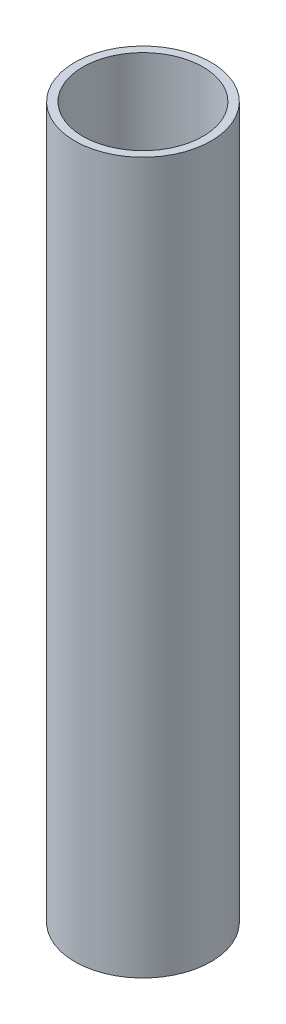
ISO-10303-21;
HEADER;
FILE_DESCRIPTION(('STEP AP214'),'2;1');
FILE_NAME('part.step','',(''),(''),'','','');
FILE_SCHEMA(('AUTOMOTIVE_DESIGN { 1 0 10303 214 1 1 1 1 }'));
ENDSEC;
DATA;
#1=APPLICATION_CONTEXT('core data for automotive mechanical design processes');
#2=APPLICATION_PROTOCOL_DEFINITION('international standard','automotive_design',2000,#1);
#3=PRODUCT_CONTEXT('',#1,'mechanical');
#4=PRODUCT('Part','Part','',(#3));
#5=PRODUCT_RELATED_PRODUCT_CATEGORY('part','',(#4));
#6=PRODUCT_DEFINITION_FORMATION('','',#4);
#7=PRODUCT_DEFINITION_CONTEXT('part definition',#1,'design');
#8=PRODUCT_DEFINITION('design','',#6,#7);
#9=PRODUCT_DEFINITION_SHAPE('','',#8);
#10=(LENGTH_UNIT() NAMED_UNIT(*) SI_UNIT(.MILLI.,.METRE.));
#11=(NAMED_UNIT(*) PLANE_ANGLE_UNIT() SI_UNIT($,.RADIAN.));
#12=(NAMED_UNIT(*) SI_UNIT($,.STERADIAN.) SOLID_ANGLE_UNIT());
#13=UNCERTAINTY_MEASURE_WITH_UNIT(LENGTH_MEASURE(1.E-05),#10,'distance_accuracy_value','');
#14=(GEOMETRIC_REPRESENTATION_CONTEXT(3) GLOBAL_UNCERTAINTY_ASSIGNED_CONTEXT((#13)) GLOBAL_UNIT_ASSIGNED_CONTEXT((#10,
#11,#12)) REPRESENTATION_CONTEXT('',''));
#15=CARTESIAN_POINT('',(0.,0.,0.));
#16=DIRECTION('',(0.,0.,1.));
#17=DIRECTION('',(1.,0.,0.));
#18=AXIS2_PLACEMENT_3D('',#15,#16,#17);
#19=CARTESIAN_POINT('',(0.,149.,0.));
#20=DIRECTION('',(0.,1.,0.));
#21=DIRECTION('',(0.,0.,1.));
#22=AXIS2_PLACEMENT_3D('',#19,#20,#21);
#23=PLANE('',#22);
#24=CARTESIAN_POINT('',(0.,149.,0.));
#25=DIRECTION('',(0.,1.,0.));
#26=DIRECTION('',(0.,0.,1.));
#27=AXIS2_PLACEMENT_3D('',#24,#25,#26);
#28=CIRCLE('',#27,28.575);
#29=CARTESIAN_POINT('',(0.,149.,28.575));
#30=VERTEX_POINT('',#29);
#31=EDGE_CURVE('E10',#30,#30,#28,.T.);
#32=ORIENTED_EDGE('',*,*,#31,.T.);
#33=EDGE_LOOP('',(#32));
#34=FACE_BOUND('',#33,.T.);
#35=CARTESIAN_POINT('',(0.,149.,0.));
#36=DIRECTION('',(0.,1.,0.));
#37=DIRECTION('',(0.,0.,1.));
#38=AXIS2_PLACEMENT_3D('',#35,#36,#37);
#39=CIRCLE('',#38,25.2);
#40=CARTESIAN_POINT('',(0.,149.,25.2));
#41=VERTEX_POINT('',#40);
#42=EDGE_CURVE('E43',#41,#41,#39,.T.);
#43=ORIENTED_EDGE('',*,*,#42,.F.);
#44=EDGE_LOOP('',(#43));
#45=FACE_BOUND('',#44,.T.);
#46=ADVANCED_FACE('F32',(#34,#45),#23,.T.);
#47=CARTESIAN_POINT('',(0.,-149.,0.));
#48=DIRECTION('',(0.,1.,0.));
#49=DIRECTION('',(0.,0.,1.));
#50=AXIS2_PLACEMENT_3D('',#47,#48,#49);
#51=PLANE('',#50);
#52=CARTESIAN_POINT('',(0.,-149.,0.));
#53=DIRECTION('',(0.,1.,0.));
#54=DIRECTION('',(0.,0.,1.));
#55=AXIS2_PLACEMENT_3D('',#52,#53,#54);
#56=CIRCLE('',#55,28.575);
#57=CARTESIAN_POINT('',(0.,-149.,28.575));
#58=VERTEX_POINT('',#57);
#59=EDGE_CURVE('E36',#58,#58,#56,.T.);
#60=ORIENTED_EDGE('',*,*,#59,.F.);
#61=EDGE_LOOP('',(#60));
#62=FACE_BOUND('',#61,.T.);
#63=CARTESIAN_POINT('',(0.,-149.,0.));
#64=DIRECTION('',(0.,1.,0.));
#65=DIRECTION('',(0.,0.,1.));
#66=AXIS2_PLACEMENT_3D('',#63,#64,#65);
#67=CIRCLE('',#66,25.2);
#68=CARTESIAN_POINT('',(0.,-149.,25.2));
#69=VERTEX_POINT('',#68);
#70=EDGE_CURVE('E45',#69,#69,#67,.T.);
#71=ORIENTED_EDGE('',*,*,#70,.T.);
#72=EDGE_LOOP('',(#71));
#73=FACE_BOUND('',#72,.T.);
#74=ADVANCED_FACE('F55',(#62,#73),#51,.F.);
#75=CARTESIAN_POINT('',(0.,149.,0.));
#76=DIRECTION('',(0.,-1.,0.));
#77=DIRECTION('',(0.,0.,-1.));
#78=AXIS2_PLACEMENT_3D('',#75,#76,#77);
#79=CYLINDRICAL_SURFACE('',#78,28.575);
#80=ORIENTED_EDGE('',*,*,#31,.F.);
#81=EDGE_LOOP('',(#80));
#82=FACE_BOUND('',#81,.T.);
#83=ORIENTED_EDGE('',*,*,#59,.T.);
#84=EDGE_LOOP('',(#83));
#85=FACE_BOUND('',#84,.T.);
#86=ADVANCED_FACE('F34',(#82,#85),#79,.T.);
#87=CARTESIAN_POINT('',(0.,149.,0.));
#88=DIRECTION('',(0.,-1.,0.));
#89=DIRECTION('',(0.,0.,-1.));
#90=AXIS2_PLACEMENT_3D('',#87,#88,#89);
#91=CYLINDRICAL_SURFACE('',#90,25.2);
#92=ORIENTED_EDGE('',*,*,#42,.T.);
#93=EDGE_LOOP('',(#92));
#94=FACE_BOUND('',#93,.T.);
#95=ORIENTED_EDGE('',*,*,#70,.F.);
#96=EDGE_LOOP('',(#95));
#97=FACE_BOUND('',#96,.T.);
#98=ADVANCED_FACE('F51',(#94,#97),#91,.F.);
#99=CLOSED_SHELL('',(#46,#74,#86,#98));
#100=MANIFOLD_SOLID_BREP('B2',#99);
#101=ADVANCED_BREP_SHAPE_REPRESENTATION('',(#18,#100),#14);
#102=SHAPE_DEFINITION_REPRESENTATION(#9,#101);
ENDSEC;
END-ISO-10303-21;
